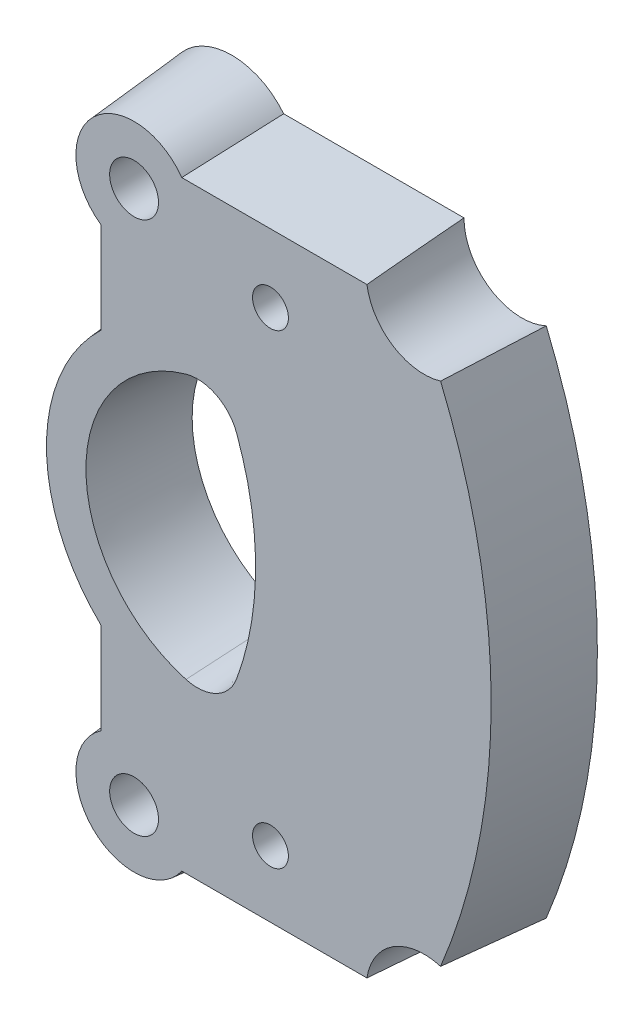
ISO-10303-21;
HEADER;
FILE_DESCRIPTION(('STEP AP214'),'2;1');
FILE_NAME('part.step','',(''),(''),'','','');
FILE_SCHEMA(('AUTOMOTIVE_DESIGN { 1 0 10303 214 1 1 1 1 }'));
ENDSEC;
DATA;
#1=APPLICATION_CONTEXT('core data for automotive mechanical design processes');
#2=APPLICATION_PROTOCOL_DEFINITION('international standard','automotive_design',2000,#1);
#3=PRODUCT_CONTEXT('',#1,'mechanical');
#4=PRODUCT('Part','Part','',(#3));
#5=PRODUCT_RELATED_PRODUCT_CATEGORY('part','',(#4));
#6=PRODUCT_DEFINITION_FORMATION('','',#4);
#7=PRODUCT_DEFINITION_CONTEXT('part definition',#1,'design');
#8=PRODUCT_DEFINITION('design','',#6,#7);
#9=PRODUCT_DEFINITION_SHAPE('','',#8);
#10=(LENGTH_UNIT() NAMED_UNIT(*) SI_UNIT(.MILLI.,.METRE.));
#11=(NAMED_UNIT(*) PLANE_ANGLE_UNIT() SI_UNIT($,.RADIAN.));
#12=(NAMED_UNIT(*) SI_UNIT($,.STERADIAN.) SOLID_ANGLE_UNIT());
#13=UNCERTAINTY_MEASURE_WITH_UNIT(LENGTH_MEASURE(1.E-05),#10,'distance_accuracy_value','');
#14=(GEOMETRIC_REPRESENTATION_CONTEXT(3) GLOBAL_UNCERTAINTY_ASSIGNED_CONTEXT((#13)) GLOBAL_UNIT_ASSIGNED_CONTEXT((#10,
#11,#12)) REPRESENTATION_CONTEXT('',''));
#15=CARTESIAN_POINT('',(0.,0.,0.));
#16=DIRECTION('',(0.,0.,1.));
#17=DIRECTION('',(1.,0.,0.));
#18=AXIS2_PLACEMENT_3D('',#15,#16,#17);
#19=CARTESIAN_POINT('',(-242.568806554444,2.20217828658414,0.));
#20=DIRECTION('',(0.,0.,-1.));
#21=DIRECTION('',(1.,0.,0.));
#22=AXIS2_PLACEMENT_3D('',#19,#20,#21);
#23=CONICAL_SURFACE('',#22,121.736376832172,0.0872664625997167);
#24=CARTESIAN_POINT('',(-242.568806554444,2.20217828658414,17.78));
#25=DIRECTION('',(0.,0.,1.));
#26=DIRECTION('',(1.,0.,0.));
#27=AXIS2_PLACEMENT_3D('',#24,#25,#26);
#28=CIRCLE('',#27,120.180828394681);
#29=CARTESIAN_POINT('',(-131.595061589543,-43.9308840667537,17.78));
#30=VERTEX_POINT('',#29);
#31=CARTESIAN_POINT('',(-131.595061589543,48.335240639922,17.78));
#32=VERTEX_POINT('',#31);
#33=EDGE_CURVE('E141',#30,#32,#28,.T.);
#34=ORIENTED_EDGE('',*,*,#33,.F.);
#35=CARTESIAN_POINT('',(-131.595078456003,-43.9308790560775,17.7802));
#36=CARTESIAN_POINT('',(-131.470129675424,-43.9680056302352,16.2985387701415));
#37=CARTESIAN_POINT('',(-131.346110667115,-44.0073703583966,14.8168558223103));
#38=CARTESIAN_POINT('',(-131.09992474476,-44.0905561661647,11.8534767240976));
#39=CARTESIAN_POINT('',(-130.977757811404,-44.134377199271,10.3717805740151));
#40=CARTESIAN_POINT('',(-130.614019120888,-44.2724964134353,5.92665973146267));
#41=CARTESIAN_POINT('',(-130.375210447984,-44.3734504193753,2.96321420670453));
#42=CARTESIAN_POINT('',(-130.140050940156,-44.4832007465658,-0.00019999999999912));
#43=B_SPLINE_CURVE_WITH_KNOTS('',3,(#35,#36,#37,#38,#39,#40,#41,#42),.UNSPECIFIED.,.F.,.F.,(4,2,
2,4),(0.,4.46214826748927,8.92424997847575,17.8484882137234),.UNSPECIFIED.);
#44=CARTESIAN_POINT('',(-130.14006680977,-44.4831933371806,0.));
#45=VERTEX_POINT('',#44);
#46=EDGE_CURVE('E132',#30,#45,#43,.T.);
#47=ORIENTED_EDGE('',*,*,#46,.T.);
#48=CARTESIAN_POINT('',(-242.568806554444,2.20217828658414,0.));
#49=DIRECTION('',(0.,0.,1.));
#50=DIRECTION('',(1.,0.,0.));
#51=AXIS2_PLACEMENT_3D('',#48,#49,#50);
#52=CIRCLE('',#51,121.736376832172);
#53=CARTESIAN_POINT('',(-130.14006680977,48.8875499103488,0.));
#54=VERTEX_POINT('',#53);
#55=EDGE_CURVE('E53',#45,#54,#52,.T.);
#56=ORIENTED_EDGE('',*,*,#55,.T.);
#57=CARTESIAN_POINT('',(-130.140050940156,48.8875573197341,-0.000200000000000176));
#58=CARTESIAN_POINT('',(-130.375210447984,48.7778069925436,2.96321420670453));
#59=CARTESIAN_POINT('',(-130.614019120888,48.6768529866035,5.92665973146267));
#60=CARTESIAN_POINT('',(-130.977757811404,48.5387337724393,10.3717805740151));
#61=CARTESIAN_POINT('',(-131.09992474476,48.4949127393329,11.8534767240976));
#62=CARTESIAN_POINT('',(-131.346110667115,48.4117269315648,14.8168558223103));
#63=CARTESIAN_POINT('',(-131.470129675424,48.3723622034034,16.2985387701415));
#64=CARTESIAN_POINT('',(-131.595078456003,48.3352356292458,17.7802));
#65=B_SPLINE_CURVE_WITH_KNOTS('',3,(#57,#58,#59,#60,#61,#62,#63,#64),.UNSPECIFIED.,.F.,.F.,(4,2,
2,4),(0.,8.92423823524763,13.3863399462341,17.8484882137234),.UNSPECIFIED.);
#66=EDGE_CURVE('E198',#54,#32,#65,.T.);
#67=ORIENTED_EDGE('',*,*,#66,.T.);
#68=EDGE_LOOP('',(#34,#47,#56,#67));
#69=FACE_BOUND('',#68,.T.);
#70=ADVANCED_FACE('F29',(#69),#23,.T.);
#71=CARTESIAN_POINT('',(-134.591688960852,58.4221704637822,0.));
#72=DIRECTION('',(0.,0.996194698091746,0.0871557427476584));
#73=DIRECTION('',(0.,-0.0871557427476584,0.996194698091746));
#74=AXIS2_PLACEMENT_3D('',#71,#72,#73);
#75=PLANE('',#74);
#76=DIRECTION('',(1.,0.,0.));
#77=VECTOR('',#76,1.);
#78=CARTESIAN_POINT('',(-134.591688960852,56.8666220262913,17.78));
#79=LINE('',#78,#77);
#80=CARTESIAN_POINT('',(-144.998715334057,56.8666220262913,17.78));
#81=VERTEX_POINT('',#80);
#82=CARTESIAN_POINT('',(-178.712968006962,56.8666220262913,17.78));
#83=VERTEX_POINT('',#82);
#84=EDGE_CURVE('E315',#81,#83,#79,.F.);
#85=ORIENTED_EDGE('',*,*,#84,.F.);
#86=CARTESIAN_POINT('',(-134.591688960852,58.4221704637822,0.));
#87=DIRECTION('',(0.,0.996194698091746,0.0871557427476584));
#88=DIRECTION('',(0.,0.0871557427476584,-0.996194698091746));
#89=AXIS2_PLACEMENT_3D('',#86,#87,#88);
#90=ELLIPSE('',#89,120.733741028745,10.5226388740637);
#91=CARTESIAN_POINT('',(-145.114327834916,58.4221704637822,0.));
#92=VERTEX_POINT('',#91);
#93=EDGE_CURVE('E309',#81,#92,#90,.F.);
#94=ORIENTED_EDGE('',*,*,#93,.T.);
#95=DIRECTION('',(-1.,0.,0.));
#96=VECTOR('',#95,1.);
#97=CARTESIAN_POINT('',(-134.591688960852,58.4221704637822,0.));
#98=LINE('',#97,#96);
#99=CARTESIAN_POINT('',(-177.936925130946,58.4221704637822,0.));
#100=VERTEX_POINT('',#99);
#101=EDGE_CURVE('E146',#92,#100,#98,.T.);
#102=ORIENTED_EDGE('',*,*,#101,.T.);
#103=CARTESIAN_POINT('',(-178.712968006962,56.8666220262913,17.78));
#104=CARTESIAN_POINT('',(-178.645414126394,56.9962400365516,16.2984593633449));
#105=CARTESIAN_POINT('',(-178.578643604253,57.1258611391595,14.8168833809947));
#106=CARTESIAN_POINT('',(-178.446573883495,57.3851089273824,11.8536676022318));
#107=CARTESIAN_POINT('',(-178.38127468361,57.5147356129925,10.3720278058751));
#108=CARTESIAN_POINT('',(-178.25205210728,57.7739941701885,7.40868893718567));
#109=CARTESIAN_POINT('',(-178.188128730634,57.9036260417738,5.92698986486156));
#110=CARTESIAN_POINT('',(-178.061576416323,58.1628946974007,2.96353557057853));
#111=CARTESIAN_POINT('',(-177.998947479774,58.2925314814466,1.48178034857231));
#112=CARTESIAN_POINT('',(-177.936925130946,58.4221704637822,0.));
#113=B_SPLINE_CURVE_WITH_KNOTS('',3,(#103,#104,#105,#106,#107,#108,#109,#110,#111,#112),
.UNSPECIFIED.,.F.,.F.,(4,2,2,2,4),(0.,4.46619972246631,8.93239559400562,13.3985908154821,
17.8647898869773),.UNSPECIFIED.);
#114=EDGE_CURVE('E38',#83,#100,#113,.T.);
#115=ORIENTED_EDGE('',*,*,#114,.F.);
#116=EDGE_LOOP('',(#85,#94,#102,#115));
#117=FACE_BOUND('',#116,.T.);
#118=ADVANCED_FACE('F193',(#117),#75,.T.);
#119=CARTESIAN_POINT('',(-187.392025381174,50.8021704637822,0.));
#120=DIRECTION('',(0.,0.,-1.));
#121=DIRECTION('',(1.,0.,0.));
#122=AXIS2_PLACEMENT_3D('',#119,#120,#121);
#123=CONICAL_SURFACE('',#122,12.1434476464412,0.0872664625997167);
#124=CARTESIAN_POINT('',(-187.392025381174,50.8021704637822,0.));
#125=DIRECTION('',(0.,0.,1.));
#126=DIRECTION('',(1.,0.,0.));
#127=AXIS2_PLACEMENT_3D('',#124,#125,#126);
#128=CIRCLE('',#127,12.1434476464412);
#129=CARTESIAN_POINT('',(-195.012025381174,41.3470702135543,0.));
#130=VERTEX_POINT('',#129);
#131=EDGE_CURVE('E149',#100,#130,#128,.T.);
#132=ORIENTED_EDGE('',*,*,#131,.T.);
#133=CARTESIAN_POINT('',(-193.456476943683,42.1231130895697,17.78));
#134=CARTESIAN_POINT('',(-193.586094953943,42.0555592090025,16.2984593633449));
#135=CARTESIAN_POINT('',(-193.715716056551,41.9887886868607,14.8168833809947));
#136=CARTESIAN_POINT('',(-193.974963844774,41.8567189661028,11.8536676022318));
#137=CARTESIAN_POINT('',(-194.104590530384,41.7914197662181,10.3720278058751));
#138=CARTESIAN_POINT('',(-194.36384908758,41.6621971898876,7.40868893718567));
#139=CARTESIAN_POINT('',(-194.493480959166,41.5982738132416,5.92698986486156));
#140=CARTESIAN_POINT('',(-194.752749614793,41.4717214989308,2.96353557057853));
#141=CARTESIAN_POINT('',(-194.882386398838,41.409092562382,1.48178034857231));
#142=CARTESIAN_POINT('',(-195.012025381174,41.3470702135543,0.));
#143=B_SPLINE_CURVE_WITH_KNOTS('',3,(#133,#134,#135,#136,#137,#138,#139,#140,#141,#142),
.UNSPECIFIED.,.F.,.F.,(4,2,2,2,4),(0.,4.46619972246631,8.93239559400562,13.3985908154821,
17.8647898869773),.UNSPECIFIED.);
#144=CARTESIAN_POINT('',(-193.456476943683,42.1231130895697,17.78));
#145=VERTEX_POINT('',#144);
#146=EDGE_CURVE('E462',#145,#130,#143,.T.);
#147=ORIENTED_EDGE('',*,*,#146,.F.);
#148=CARTESIAN_POINT('',(-187.392025381174,50.8021704637822,17.78));
#149=DIRECTION('',(0.,0.,1.));
#150=DIRECTION('',(1.,0.,0.));
#151=AXIS2_PLACEMENT_3D('',#148,#149,#150);
#152=CIRCLE('',#151,10.5878992089503);
#153=EDGE_CURVE('E319',#83,#145,#152,.T.);
#154=ORIENTED_EDGE('',*,*,#153,.F.);
#155=ORIENTED_EDGE('',*,*,#114,.T.);
#156=EDGE_LOOP('',(#132,#147,#154,#155));
#157=FACE_BOUND('',#156,.T.);
#158=ADVANCED_FACE('F31',(#157),#123,.T.);
#159=CARTESIAN_POINT('',(-195.012025381174,26.0628599441298,0.));
#160=DIRECTION('',(-0.996194698091746,0.,0.0871557427476584));
#161=DIRECTION('',(0.0871557427476584,0.,0.996194698091746));
#162=AXIS2_PLACEMENT_3D('',#159,#160,#161);
#163=PLANE('',#162);
#164=DIRECTION('',(0.,-1.,0.));
#165=VECTOR('',#164,1.);
#166=CARTESIAN_POINT('',(-195.012025381174,26.0628599441298,0.));
#167=LINE('',#166,#165);
#168=CARTESIAN_POINT('',(-195.012025381174,26.0628599441298,0.));
#169=VERTEX_POINT('',#168);
#170=EDGE_CURVE('E157',#130,#169,#167,.T.);
#171=ORIENTED_EDGE('',*,*,#170,.T.);
#172=CARTESIAN_POINT('',(-193.456476943683,25.4095878461253,17.78));
#173=CARTESIAN_POINT('',(-193.715730202941,25.5199755947637,14.8167216870205));
#174=CARTESIAN_POINT('',(-193.974985869224,25.6296088106648,11.8534158616148));
#175=CARTESIAN_POINT('',(-194.493502015055,25.8473661766618,5.92674919494794));
#176=CARTESIAN_POINT('',(-194.752762494602,25.9554903267622,2.96338835368704));
#177=CARTESIAN_POINT('',(-195.012025381174,26.0628599441298,0.));
#178=B_SPLINE_CURVE_WITH_KNOTS('',3,(#172,#173,#174,#175,#176,#177),.UNSPECIFIED.,.F.,.F.,(4,2,
4),(0.,8.92993444638388,17.8598688656546),.UNSPECIFIED.);
#179=CARTESIAN_POINT('',(-193.456476943683,25.4095878461253,17.78));
#180=VERTEX_POINT('',#179);
#181=EDGE_CURVE('E467',#180,#169,#178,.T.);
#182=ORIENTED_EDGE('',*,*,#181,.F.);
#183=DIRECTION('',(0.,1.,0.));
#184=VECTOR('',#183,1.);
#185=CARTESIAN_POINT('',(-193.456476943683,26.0628599441298,17.78));
#186=LINE('',#185,#184);
#187=EDGE_CURVE('E321',#145,#180,#186,.F.);
#188=ORIENTED_EDGE('',*,*,#187,.F.);
#189=ORIENTED_EDGE('',*,*,#146,.T.);
#190=EDGE_LOOP('',(#171,#182,#188,#189));
#191=FACE_BOUND('',#190,.T.);
#192=ADVANCED_FACE('F436',(#191),#163,.T.);
#193=CARTESIAN_POINT('',(-171.151343723628,2.20217828658414,0.));
#194=DIRECTION('',(0.,0.,-1.));
#195=DIRECTION('',(1.,0.,0.));
#196=AXIS2_PLACEMENT_3D('',#193,#194,#195);
#197=CONICAL_SURFACE('',#196,33.7440996075683,0.0872664625997167);
#198=CARTESIAN_POINT('',(-171.151343723628,2.20217828658414,0.));
#199=DIRECTION('',(0.,0.,1.));
#200=DIRECTION('',(1.,0.,0.));
#201=AXIS2_PLACEMENT_3D('',#198,#199,#200);
#202=CIRCLE('',#201,33.7440996075683);
#203=CARTESIAN_POINT('',(-195.012025381174,-21.6585033709615,0.));
#204=VERTEX_POINT('',#203);
#205=EDGE_CURVE('E159',#169,#204,#202,.T.);
#206=ORIENTED_EDGE('',*,*,#205,.T.);
#207=CARTESIAN_POINT('',(-193.456476943683,-21.005231272957,17.78));
#208=CARTESIAN_POINT('',(-193.715730202941,-21.1156190215955,14.8167216870205));
#209=CARTESIAN_POINT('',(-193.974985869224,-21.2252522374966,11.8534158616148));
#210=CARTESIAN_POINT('',(-194.493502015055,-21.4430096034935,5.92674919494794));
#211=CARTESIAN_POINT('',(-194.752762494602,-21.5511337535939,2.96338835368704));
#212=CARTESIAN_POINT('',(-195.012025381174,-21.6585033709615,0.));
#213=B_SPLINE_CURVE_WITH_KNOTS('',3,(#207,#208,#209,#210,#211,#212),.UNSPECIFIED.,.F.,.F.,(4,2,
4),(0.,8.92993444638388,17.8598688656546),.UNSPECIFIED.);
#214=CARTESIAN_POINT('',(-193.456476943683,-21.005231272957,17.78));
#215=VERTEX_POINT('',#214);
#216=EDGE_CURVE('E475',#215,#204,#213,.T.);
#217=ORIENTED_EDGE('',*,*,#216,.F.);
#218=CARTESIAN_POINT('',(-171.151343723628,2.20217828658414,17.78));
#219=DIRECTION('',(0.,0.,1.));
#220=DIRECTION('',(1.,0.,0.));
#221=AXIS2_PLACEMENT_3D('',#218,#219,#220);
#222=CIRCLE('',#221,32.1885511700774);
#223=EDGE_CURVE('E327',#180,#215,#222,.T.);
#224=ORIENTED_EDGE('',*,*,#223,.F.);
#225=ORIENTED_EDGE('',*,*,#181,.T.);
#226=EDGE_LOOP('',(#206,#217,#224,#225));
#227=FACE_BOUND('',#226,.T.);
#228=ADVANCED_FACE('F429',(#227),#197,.T.);
#229=CARTESIAN_POINT('',(-195.012025381174,-36.9427136403861,0.));
#230=DIRECTION('',(-0.996194698091746,0.,0.0871557427476584));
#231=DIRECTION('',(0.0871557427476584,0.,0.996194698091746));
#232=AXIS2_PLACEMENT_3D('',#229,#230,#231);
#233=PLANE('',#232);
#234=DIRECTION('',(0.,-1.,0.));
#235=VECTOR('',#234,1.);
#236=CARTESIAN_POINT('',(-195.012025381174,-36.9427136403861,0.));
#237=LINE('',#236,#235);
#238=CARTESIAN_POINT('',(-195.012025381174,-36.9427136403861,0.));
#239=VERTEX_POINT('',#238);
#240=EDGE_CURVE('E161',#204,#239,#237,.T.);
#241=ORIENTED_EDGE('',*,*,#240,.T.);
#242=CARTESIAN_POINT('',(-193.456476943683,-37.7187565164014,17.78));
#243=CARTESIAN_POINT('',(-193.586094953943,-37.6512026358342,16.2984593633449));
#244=CARTESIAN_POINT('',(-193.715716056551,-37.5844321136924,14.8168833809947));
#245=CARTESIAN_POINT('',(-193.974963844774,-37.4523623929345,11.8536676022318));
#246=CARTESIAN_POINT('',(-194.104590530384,-37.3870631930498,10.3720278058751));
#247=CARTESIAN_POINT('',(-194.36384908758,-37.2578406167194,7.40868893718567));
#248=CARTESIAN_POINT('',(-194.493480959166,-37.1939172400733,5.92698986486156));
#249=CARTESIAN_POINT('',(-194.752749614793,-37.0673649257626,2.96353557057853));
#250=CARTESIAN_POINT('',(-194.882386398838,-37.0047359892137,1.48178034857231));
#251=CARTESIAN_POINT('',(-195.012025381174,-36.9427136403861,0.));
#252=B_SPLINE_CURVE_WITH_KNOTS('',3,(#242,#243,#244,#245,#246,#247,#248,#249,#250,#251),
.UNSPECIFIED.,.F.,.F.,(4,2,2,2,4),(0.,4.46619972246631,8.93239559400562,13.3985908154821,
17.8647898869773),.UNSPECIFIED.);
#253=CARTESIAN_POINT('',(-193.456476943683,-37.7187565164014,17.78));
#254=VERTEX_POINT('',#253);
#255=EDGE_CURVE('E175',#254,#239,#252,.T.);
#256=ORIENTED_EDGE('',*,*,#255,.F.);
#257=DIRECTION('',(0.,1.,0.));
#258=VECTOR('',#257,1.);
#259=CARTESIAN_POINT('',(-193.456476943683,-36.9427136403861,17.78));
#260=LINE('',#259,#258);
#261=EDGE_CURVE('E329',#215,#254,#260,.F.);
#262=ORIENTED_EDGE('',*,*,#261,.F.);
#263=ORIENTED_EDGE('',*,*,#216,.T.);
#264=EDGE_LOOP('',(#241,#256,#262,#263));
#265=FACE_BOUND('',#264,.T.);
#266=ADVANCED_FACE('F422',(#265),#233,.T.);
#267=CARTESIAN_POINT('',(-187.392025381174,-46.3978138906139,0.));
#268=DIRECTION('',(0.,0.,-1.));
#269=DIRECTION('',(1.,0.,0.));
#270=AXIS2_PLACEMENT_3D('',#267,#268,#269);
#271=CONICAL_SURFACE('',#270,12.1434476464412,0.0872664625997167);
#272=CARTESIAN_POINT('',(-187.392025381174,-46.3978138906139,0.));
#273=DIRECTION('',(0.,0.,1.));
#274=DIRECTION('',(1.,0.,0.));
#275=AXIS2_PLACEMENT_3D('',#272,#273,#274);
#276=CIRCLE('',#275,12.1434476464412);
#277=CARTESIAN_POINT('',(-177.936925130946,-54.0178138906139,0.));
#278=VERTEX_POINT('',#277);
#279=EDGE_CURVE('E163',#239,#278,#276,.T.);
#280=ORIENTED_EDGE('',*,*,#279,.T.);
#281=CARTESIAN_POINT('',(-178.712968006962,-52.462265453123,17.78));
#282=CARTESIAN_POINT('',(-178.645414126394,-52.5918834633833,16.2984593633449));
#283=CARTESIAN_POINT('',(-178.578643604253,-52.7215045659912,14.8168833809947));
#284=CARTESIAN_POINT('',(-178.446573883495,-52.9807523542141,11.8536676022318));
#285=CARTESIAN_POINT('',(-178.38127468361,-53.1103790398242,10.3720278058751));
#286=CARTESIAN_POINT('',(-178.25205210728,-53.3696375970203,7.40868893718567));
#287=CARTESIAN_POINT('',(-178.188128730634,-53.4992694686055,5.92698986486156));
#288=CARTESIAN_POINT('',(-178.061576416323,-53.7585381242325,2.96353557057853));
#289=CARTESIAN_POINT('',(-177.998947479774,-53.8881749082784,1.48178034857231));
#290=CARTESIAN_POINT('',(-177.936925130946,-54.0178138906139,0.));
#291=B_SPLINE_CURVE_WITH_KNOTS('',3,(#281,#282,#283,#284,#285,#286,#287,#288,#289,#290),
.UNSPECIFIED.,.F.,.F.,(4,2,2,2,4),(0.,4.46619972246631,8.93239559400562,13.3985908154821,
17.8647898869772),.UNSPECIFIED.);
#292=CARTESIAN_POINT('',(-178.712968006962,-52.462265453123,17.78));
#293=VERTEX_POINT('',#292);
#294=EDGE_CURVE('E167',#293,#278,#291,.T.);
#295=ORIENTED_EDGE('',*,*,#294,.F.);
#296=CARTESIAN_POINT('',(-187.392025381174,-46.3978138906139,17.78));
#297=DIRECTION('',(0.,0.,1.));
#298=DIRECTION('',(1.,0.,0.));
#299=AXIS2_PLACEMENT_3D('',#296,#297,#298);
#300=CIRCLE('',#299,10.5878992089503);
#301=EDGE_CURVE('E331',#254,#293,#300,.T.);
#302=ORIENTED_EDGE('',*,*,#301,.F.);
#303=ORIENTED_EDGE('',*,*,#255,.T.);
#304=EDGE_LOOP('',(#280,#295,#302,#303));
#305=FACE_BOUND('',#304,.T.);
#306=ADVANCED_FACE('F182',(#305),#271,.T.);
#307=CARTESIAN_POINT('',(-134.591688960852,-54.0178138906139,0.));
#308=DIRECTION('',(0.,-0.996194698091746,0.0871557427476584));
#309=DIRECTION('',(0.,-0.0871557427476584,-0.996194698091746));
#310=AXIS2_PLACEMENT_3D('',#307,#308,#309);
#311=PLANE('',#310);
#312=DIRECTION('',(1.,0.,0.));
#313=VECTOR('',#312,1.);
#314=CARTESIAN_POINT('',(-134.591688960852,-54.0178138906139,0.));
#315=LINE('',#314,#313);
#316=CARTESIAN_POINT('',(-145.114327834916,-54.0178138906139,0.));
#317=VERTEX_POINT('',#316);
#318=EDGE_CURVE('E165',#278,#317,#315,.T.);
#319=ORIENTED_EDGE('',*,*,#318,.T.);
#320=CARTESIAN_POINT('',(-134.591688960852,-54.0178138906139,0.));
#321=DIRECTION('',(0.,-0.996194698091746,0.0871557427476584));
#322=DIRECTION('',(0.,-0.0871557427476584,-0.996194698091746));
#323=AXIS2_PLACEMENT_3D('',#320,#321,#322);
#324=ELLIPSE('',#323,120.733741028745,10.5226388740637);
#325=CARTESIAN_POINT('',(-144.998715334057,-52.462265453123,17.78));
#326=VERTEX_POINT('',#325);
#327=EDGE_CURVE('E45',#317,#326,#324,.F.);
#328=ORIENTED_EDGE('',*,*,#327,.T.);
#329=DIRECTION('',(-1.,0.,0.));
#330=VECTOR('',#329,1.);
#331=CARTESIAN_POINT('',(-134.591688960852,-52.462265453123,17.78));
#332=LINE('',#331,#330);
#333=EDGE_CURVE('E176',#293,#326,#332,.F.);
#334=ORIENTED_EDGE('',*,*,#333,.F.);
#335=ORIENTED_EDGE('',*,*,#294,.T.);
#336=EDGE_LOOP('',(#319,#328,#334,#335));
#337=FACE_BOUND('',#336,.T.);
#338=ADVANCED_FACE('F184',(#337),#311,.T.);
#339=CARTESIAN_POINT('',(-242.568806554444,2.20217828658414,17.78));
#340=DIRECTION('',(0.,0.,1.));
#341=DIRECTION('',(1.,0.,0.));
#342=AXIS2_PLACEMENT_3D('',#339,#340,#341);
#343=PLANE('',#342);
#344=CARTESIAN_POINT('',(-162.563054604076,-40.3948827833183,17.78));
#345=DIRECTION('',(0.,0.,1.));
#346=DIRECTION('',(1.,0.,0.));
#347=AXIS2_PLACEMENT_3D('',#344,#345,#346);
#348=CIRCLE('',#347,3.26389999999998);
#349=CARTESIAN_POINT('',(-159.299154604076,-40.3948827833183,17.78));
#350=VERTEX_POINT('',#349);
#351=EDGE_CURVE('E256',#350,#350,#348,.T.);
#352=ORIENTED_EDGE('',*,*,#351,.F.);
#353=EDGE_LOOP('',(#352));
#354=FACE_BOUND('',#353,.T.);
#355=CARTESIAN_POINT('',(-162.563054604076,44.4304336329383,17.78));
#356=DIRECTION('',(0.,0.,1.));
#357=DIRECTION('',(1.,0.,0.));
#358=AXIS2_PLACEMENT_3D('',#355,#356,#357);
#359=CIRCLE('',#358,3.26389999999998);
#360=CARTESIAN_POINT('',(-159.299154604076,44.4304336329383,17.78));
#361=VERTEX_POINT('',#360);
#362=EDGE_CURVE('E260',#361,#361,#359,.T.);
#363=ORIENTED_EDGE('',*,*,#362,.F.);
#364=EDGE_LOOP('',(#363));
#365=FACE_BOUND('',#364,.T.);
#366=CARTESIAN_POINT('',(-134.591688960852,-54.0178138906139,17.78));
#367=DIRECTION('',(0.,0.,1.));
#368=DIRECTION('',(1.,0.,0.));
#369=AXIS2_PLACEMENT_3D('',#366,#367,#368);
#370=CIRCLE('',#369,10.5226388740637);
#371=EDGE_CURVE('E137',#30,#326,#370,.T.);
#372=ORIENTED_EDGE('',*,*,#371,.F.);
#373=ORIENTED_EDGE('',*,*,#33,.T.);
#374=CARTESIAN_POINT('',(-134.591688960852,58.4221704637822,17.78));
#375=DIRECTION('',(0.,0.,1.));
#376=DIRECTION('',(1.,0.,0.));
#377=AXIS2_PLACEMENT_3D('',#374,#375,#376);
#378=CIRCLE('',#377,10.5226388740637);
#379=EDGE_CURVE('E142',#81,#32,#378,.T.);
#380=ORIENTED_EDGE('',*,*,#379,.F.);
#381=ORIENTED_EDGE('',*,*,#84,.T.);
#382=ORIENTED_EDGE('',*,*,#153,.T.);
#383=ORIENTED_EDGE('',*,*,#187,.T.);
#384=ORIENTED_EDGE('',*,*,#223,.T.);
#385=ORIENTED_EDGE('',*,*,#261,.T.);
#386=ORIENTED_EDGE('',*,*,#301,.T.);
#387=ORIENTED_EDGE('',*,*,#333,.T.);
#388=EDGE_LOOP('',(#372,#373,#380,#381,#382,#383,#384,#385,#386,#387));
#389=FACE_BOUND('',#388,.T.);
#390=CARTESIAN_POINT('',(-175.868653855233,18.9332147605841,17.78));
#391=DIRECTION('',(0.,0.,1.));
#392=DIRECTION('',(1.,0.,0.));
#393=AXIS2_PLACEMENT_3D('',#390,#391,#392);
#394=CIRCLE('',#393,7.62);
#395=CARTESIAN_POINT('',(-168.717269730354,21.5642041369273,17.78));
#396=VERTEX_POINT('',#395);
#397=CARTESIAN_POINT('',(-177.93648995803,26.2672759719435,17.78));
#398=VERTEX_POINT('',#397);
#399=EDGE_CURVE('E267',#396,#398,#394,.T.);
#400=ORIENTED_EDGE('',*,*,#399,.F.);
#401=CARTESIAN_POINT('',(-221.345868514014,2.20217828658414,17.78));
#402=DIRECTION('',(0.,0.,1.));
#403=DIRECTION('',(-1.,0.,0.));
#404=AXIS2_PLACEMENT_3D('',#401,#402,#403);
#405=CIRCLE('',#404,56.0772454295035);
#406=CARTESIAN_POINT('',(-168.717269730354,-17.159847563759,17.78));
#407=VERTEX_POINT('',#406);
#408=EDGE_CURVE('E294',#407,#396,#405,.T.);
#409=ORIENTED_EDGE('',*,*,#408,.F.);
#410=CARTESIAN_POINT('',(-175.868653855233,-14.5288581874158,17.78));
#411=DIRECTION('',(0.,0.,1.));
#412=DIRECTION('',(-1.,0.,0.));
#413=AXIS2_PLACEMENT_3D('',#410,#411,#412);
#414=CIRCLE('',#413,7.62);
#415=CARTESIAN_POINT('',(-177.93648995803,-21.8629193987753,17.78));
#416=VERTEX_POINT('',#415);
#417=EDGE_CURVE('E304',#416,#407,#414,.T.);
#418=ORIENTED_EDGE('',*,*,#417,.F.);
#419=CARTESIAN_POINT('',(-171.151343723628,2.20217828658414,17.78));
#420=DIRECTION('',(0.,0.,1.));
#421=DIRECTION('',(1.,0.,0.));
#422=AXIS2_PLACEMENT_3D('',#419,#420,#421);
#423=CIRCLE('',#422,25.0033424971166);
#424=EDGE_CURVE('E307',#398,#416,#423,.T.);
#425=ORIENTED_EDGE('',*,*,#424,.F.);
#426=EDGE_LOOP('',(#400,#409,#418,#425));
#427=FACE_BOUND('',#426,.T.);
#428=CARTESIAN_POINT('',(-187.392025381174,-46.3978138906139,17.7800000000161));
#429=DIRECTION('',(0.,0.,1.));
#430=DIRECTION('',(1.,0.,0.));
#431=AXIS2_PLACEMENT_3D('',#428,#429,#430);
#432=CIRCLE('',#431,4.445);
#433=CARTESIAN_POINT('',(-182.947025381174,-46.3978138906139,17.7800000000161));
#434=VERTEX_POINT('',#433);
#435=EDGE_CURVE('E271',#434,#434,#432,.T.);
#436=ORIENTED_EDGE('',*,*,#435,.F.);
#437=EDGE_LOOP('',(#436));
#438=FACE_BOUND('',#437,.T.);
#439=CARTESIAN_POINT('',(-187.392025381174,50.8021704637822,17.7800000000161));
#440=DIRECTION('',(0.,0.,1.));
#441=DIRECTION('',(1.,0.,0.));
#442=AXIS2_PLACEMENT_3D('',#439,#440,#441);
#443=CIRCLE('',#442,4.445);
#444=CARTESIAN_POINT('',(-182.947025381174,50.8021704637822,17.7800000000161));
#445=VERTEX_POINT('',#444);
#446=EDGE_CURVE('E152',#445,#445,#443,.T.);
#447=ORIENTED_EDGE('',*,*,#446,.F.);
#448=EDGE_LOOP('',(#447));
#449=FACE_BOUND('',#448,.T.);
#450=ADVANCED_FACE('F188',(#354,#365,#389,#427,#438,#449),#343,.T.);
#451=CARTESIAN_POINT('',(-242.568806554444,2.20217828658414,0.));
#452=DIRECTION('',(0.,0.,1.));
#453=DIRECTION('',(1.,0.,0.));
#454=AXIS2_PLACEMENT_3D('',#451,#452,#453);
#455=PLANE('',#454);
#456=CARTESIAN_POINT('',(-221.345868514014,2.20217828658414,0.));
#457=DIRECTION('',(0.,0.,1.));
#458=DIRECTION('',(1.,0.,0.));
#459=AXIS2_PLACEMENT_3D('',#456,#457,#458);
#460=CIRCLE('',#459,54.5216969920125);
#461=CARTESIAN_POINT('',(-170.177154822395,-16.622756827089,0.));
#462=VERTEX_POINT('',#461);
#463=CARTESIAN_POINT('',(-170.177154822395,21.0271134002572,0.));
#464=VERTEX_POINT('',#463);
#465=EDGE_CURVE('E288',#462,#464,#460,.T.);
#466=ORIENTED_EDGE('',*,*,#465,.T.);
#467=CARTESIAN_POINT('',(-175.868653855233,18.9332147605841,0.));
#468=DIRECTION('',(0.,0.,1.));
#469=DIRECTION('',(1.,0.,0.));
#470=AXIS2_PLACEMENT_3D('',#467,#468,#469);
#471=CIRCLE('',#470,6.06445156250906);
#472=CARTESIAN_POINT('',(-177.51436145164,24.7700991402122,0.));
#473=VERTEX_POINT('',#472);
#474=EDGE_CURVE('E285',#464,#473,#471,.T.);
#475=ORIENTED_EDGE('',*,*,#474,.T.);
#476=CARTESIAN_POINT('',(-171.151343723628,2.20217828658414,0.));
#477=DIRECTION('',(0.,0.,1.));
#478=DIRECTION('',(1.,0.,0.));
#479=AXIS2_PLACEMENT_3D('',#476,#477,#478);
#480=CIRCLE('',#479,23.4477940596257);
#481=CARTESIAN_POINT('',(-177.51436145164,-20.3657425670439,0.));
#482=VERTEX_POINT('',#481);
#483=EDGE_CURVE('E281',#473,#482,#480,.T.);
#484=ORIENTED_EDGE('',*,*,#483,.T.);
#485=CARTESIAN_POINT('',(-175.868653855233,-14.5288581874158,0.));
#486=DIRECTION('',(0.,0.,1.));
#487=DIRECTION('',(1.,0.,0.));
#488=AXIS2_PLACEMENT_3D('',#485,#486,#487);
#489=CIRCLE('',#488,6.06445156250906);
#490=EDGE_CURVE('E284',#482,#462,#489,.T.);
#491=ORIENTED_EDGE('',*,*,#490,.T.);
#492=EDGE_LOOP('',(#466,#475,#484,#491));
#493=FACE_BOUND('',#492,.T.);
#494=CARTESIAN_POINT('',(-187.392025381174,-46.3978138906139,0.));
#495=DIRECTION('',(0.,0.,1.));
#496=DIRECTION('',(1.,0.,0.));
#497=AXIS2_PLACEMENT_3D('',#494,#495,#496);
#498=CIRCLE('',#497,4.445);
#499=CARTESIAN_POINT('',(-182.947025381174,-46.3978138906139,0.));
#500=VERTEX_POINT('',#499);
#501=EDGE_CURVE('E275',#500,#500,#498,.T.);
#502=ORIENTED_EDGE('',*,*,#501,.T.);
#503=EDGE_LOOP('',(#502));
#504=FACE_BOUND('',#503,.T.);
#505=CARTESIAN_POINT('',(-187.392025381174,50.8021704637822,0.));
#506=DIRECTION('',(0.,0.,1.));
#507=DIRECTION('',(1.,0.,0.));
#508=AXIS2_PLACEMENT_3D('',#505,#506,#507);
#509=CIRCLE('',#508,4.445);
#510=CARTESIAN_POINT('',(-182.947025381174,50.8021704637822,0.));
#511=VERTEX_POINT('',#510);
#512=EDGE_CURVE('E147',#511,#511,#509,.T.);
#513=ORIENTED_EDGE('',*,*,#512,.T.);
#514=EDGE_LOOP('',(#513));
#515=FACE_BOUND('',#514,.T.);
#516=ORIENTED_EDGE('',*,*,#55,.F.);
#517=CARTESIAN_POINT('',(-134.591688960852,-54.0178138906139,0.));
#518=DIRECTION('',(0.,0.,-1.));
#519=DIRECTION('',(-1.,0.,0.));
#520=AXIS2_PLACEMENT_3D('',#517,#518,#519);
#521=CIRCLE('',#520,10.5226388740637);
#522=EDGE_CURVE('E130',#317,#45,#521,.T.);
#523=ORIENTED_EDGE('',*,*,#522,.F.);
#524=ORIENTED_EDGE('',*,*,#318,.F.);
#525=ORIENTED_EDGE('',*,*,#279,.F.);
#526=ORIENTED_EDGE('',*,*,#240,.F.);
#527=ORIENTED_EDGE('',*,*,#205,.F.);
#528=ORIENTED_EDGE('',*,*,#170,.F.);
#529=ORIENTED_EDGE('',*,*,#131,.F.);
#530=ORIENTED_EDGE('',*,*,#101,.F.);
#531=CARTESIAN_POINT('',(-134.591688960852,58.4221704637822,0.));
#532=DIRECTION('',(0.,0.,1.));
#533=DIRECTION('',(1.,0.,0.));
#534=AXIS2_PLACEMENT_3D('',#531,#532,#533);
#535=CIRCLE('',#534,10.5226388740637);
#536=EDGE_CURVE('E11',#92,#54,#535,.T.);
#537=ORIENTED_EDGE('',*,*,#536,.T.);
#538=EDGE_LOOP('',(#516,#523,#524,#525,#526,#527,#528,#529,#530,#537));
#539=FACE_BOUND('',#538,.T.);
#540=ADVANCED_FACE('F144',(#493,#504,#515,#539),#455,.F.);
#541=CARTESIAN_POINT('',(-187.392025381174,50.8021704637822,0.));
#542=DIRECTION('',(0.,0.,1.));
#543=DIRECTION('',(1.,0.,0.));
#544=AXIS2_PLACEMENT_3D('',#541,#542,#543);
#545=CYLINDRICAL_SURFACE('',#544,4.445);
#546=ORIENTED_EDGE('',*,*,#512,.F.);
#547=EDGE_LOOP('',(#546));
#548=FACE_BOUND('',#547,.T.);
#549=ORIENTED_EDGE('',*,*,#446,.T.);
#550=EDGE_LOOP('',(#549));
#551=FACE_BOUND('',#550,.T.);
#552=ADVANCED_FACE('F241',(#548,#551),#545,.F.);
#553=CARTESIAN_POINT('',(-187.392025381174,-46.3978138906139,0.));
#554=DIRECTION('',(0.,0.,1.));
#555=DIRECTION('',(1.,0.,0.));
#556=AXIS2_PLACEMENT_3D('',#553,#554,#555);
#557=CYLINDRICAL_SURFACE('',#556,4.445);
#558=ORIENTED_EDGE('',*,*,#501,.F.);
#559=EDGE_LOOP('',(#558));
#560=FACE_BOUND('',#559,.T.);
#561=ORIENTED_EDGE('',*,*,#435,.T.);
#562=EDGE_LOOP('',(#561));
#563=FACE_BOUND('',#562,.T.);
#564=ADVANCED_FACE('F227',(#560,#563),#557,.F.);
#565=CARTESIAN_POINT('',(-175.868653855233,18.9332147605841,17.78));
#566=DIRECTION('',(0.,0.,1.));
#567=DIRECTION('',(1.,0.,0.));
#568=AXIS2_PLACEMENT_3D('',#565,#566,#567);
#569=CONICAL_SURFACE('',#568,7.62,0.0872664625997167);
#570=ORIENTED_EDGE('',*,*,#399,.T.);
#571=DIRECTION('',(-0.0236514161968154,0.083885243075174,0.996194698091745));
#572=VECTOR('',#571,1.);
#573=CARTESIAN_POINT('',(-177.93648995803,26.2672759719435,17.78));
#574=LINE('',#573,#572);
#575=EDGE_CURVE('E291',#473,#398,#574,.T.);
#576=ORIENTED_EDGE('',*,*,#575,.F.);
#577=ORIENTED_EDGE('',*,*,#474,.F.);
#578=DIRECTION('',(0.081795826125673,0.0300926290362718,0.996194698091745));
#579=VECTOR('',#578,1.);
#580=CARTESIAN_POINT('',(-168.717269730354,21.5642041369273,17.78));
#581=LINE('',#580,#579);
#582=EDGE_CURVE('E280',#464,#396,#581,.T.);
#583=ORIENTED_EDGE('',*,*,#582,.T.);
#584=EDGE_LOOP('',(#570,#576,#577,#583));
#585=FACE_BOUND('',#584,.T.);
#586=ADVANCED_FACE('F223',(#585),#569,.F.);
#587=CARTESIAN_POINT('',(-221.345868514014,2.20217828658414,17.78));
#588=DIRECTION('',(0.,0.,1.));
#589=DIRECTION('',(-1.,0.,0.));
#590=AXIS2_PLACEMENT_3D('',#587,#588,#589);
#591=CONICAL_SURFACE('',#590,56.0772454295035,0.0872664625997167);
#592=ORIENTED_EDGE('',*,*,#408,.T.);
#593=ORIENTED_EDGE('',*,*,#582,.F.);
#594=ORIENTED_EDGE('',*,*,#465,.F.);
#595=DIRECTION('',(0.081795826125673,-0.0300926290362719,0.996194698091745));
#596=VECTOR('',#595,1.);
#597=CARTESIAN_POINT('',(-168.717269730354,-17.159847563759,17.78));
#598=LINE('',#597,#596);
#599=EDGE_CURVE('E295',#462,#407,#598,.T.);
#600=ORIENTED_EDGE('',*,*,#599,.T.);
#601=EDGE_LOOP('',(#592,#593,#594,#600));
#602=FACE_BOUND('',#601,.T.);
#603=ADVANCED_FACE('F226',(#602),#591,.F.);
#604=CARTESIAN_POINT('',(-175.868653855233,-14.5288581874158,17.78));
#605=DIRECTION('',(0.,0.,1.));
#606=DIRECTION('',(-1.,0.,0.));
#607=AXIS2_PLACEMENT_3D('',#604,#605,#606);
#608=CONICAL_SURFACE('',#607,7.62,0.0872664625997167);
#609=ORIENTED_EDGE('',*,*,#417,.T.);
#610=ORIENTED_EDGE('',*,*,#599,.F.);
#611=ORIENTED_EDGE('',*,*,#490,.F.);
#612=DIRECTION('',(-0.0236514161968154,-0.0838852430751739,0.996194698091745));
#613=VECTOR('',#612,1.);
#614=CARTESIAN_POINT('',(-177.93648995803,-21.8629193987753,17.78));
#615=LINE('',#614,#613);
#616=EDGE_CURVE('E297',#482,#416,#615,.T.);
#617=ORIENTED_EDGE('',*,*,#616,.T.);
#618=EDGE_LOOP('',(#609,#610,#611,#617));
#619=FACE_BOUND('',#618,.T.);
#620=ADVANCED_FACE('F231',(#619),#608,.F.);
#621=CARTESIAN_POINT('',(-171.151343723628,2.20217828658414,17.78));
#622=DIRECTION('',(0.,0.,1.));
#623=DIRECTION('',(1.,0.,0.));
#624=AXIS2_PLACEMENT_3D('',#621,#622,#623);
#625=CONICAL_SURFACE('',#624,25.0033424971166,0.0872664625997167);
#626=ORIENTED_EDGE('',*,*,#424,.T.);
#627=ORIENTED_EDGE('',*,*,#616,.F.);
#628=ORIENTED_EDGE('',*,*,#483,.F.);
#629=ORIENTED_EDGE('',*,*,#575,.T.);
#630=EDGE_LOOP('',(#626,#627,#628,#629));
#631=FACE_BOUND('',#630,.T.);
#632=ADVANCED_FACE('F221',(#631),#625,.F.);
#633=CARTESIAN_POINT('',(-134.591688960852,58.4221704637822,26.162));
#634=DIRECTION('',(0.,0.,-1.));
#635=DIRECTION('',(-1.,0.,0.));
#636=AXIS2_PLACEMENT_3D('',#633,#634,#635);
#637=CYLINDRICAL_SURFACE('',#636,10.5226388740637);
#638=ORIENTED_EDGE('',*,*,#536,.F.);
#639=ORIENTED_EDGE('',*,*,#93,.F.);
#640=ORIENTED_EDGE('',*,*,#379,.T.);
#641=ORIENTED_EDGE('',*,*,#66,.F.);
#642=EDGE_LOOP('',(#638,#639,#640,#641));
#643=FACE_BOUND('',#642,.T.);
#644=ADVANCED_FACE('F216',(#643),#637,.F.);
#645=CARTESIAN_POINT('',(-134.591688960852,-54.0178138906139,26.162));
#646=DIRECTION('',(0.,0.,-1.));
#647=DIRECTION('',(-1.,0.,0.));
#648=AXIS2_PLACEMENT_3D('',#645,#646,#647);
#649=CYLINDRICAL_SURFACE('',#648,10.5226388740637);
#650=ORIENTED_EDGE('',*,*,#371,.T.);
#651=ORIENTED_EDGE('',*,*,#327,.F.);
#652=ORIENTED_EDGE('',*,*,#522,.T.);
#653=ORIENTED_EDGE('',*,*,#46,.F.);
#654=EDGE_LOOP('',(#650,#651,#652,#653));
#655=FACE_BOUND('',#654,.T.);
#656=ADVANCED_FACE('F131',(#655),#649,.F.);
#657=CARTESIAN_POINT('',(-162.563054604076,44.4304336329383,10.16));
#658=DIRECTION('',(0.,0.,1.));
#659=DIRECTION('',(1.,0.,0.));
#660=AXIS2_PLACEMENT_3D('',#657,#658,#659);
#661=CYLINDRICAL_SURFACE('',#660,3.26389999999998);
#662=CARTESIAN_POINT('',(-162.563054604076,44.4304336329383,10.16));
#663=DIRECTION('',(0.,0.,1.));
#664=DIRECTION('',(1.,0.,0.));
#665=AXIS2_PLACEMENT_3D('',#662,#663,#664);
#666=CIRCLE('',#665,3.26389999999998);
#667=CARTESIAN_POINT('',(-159.299154604076,44.4304336329383,10.16));
#668=VERTEX_POINT('',#667);
#669=EDGE_CURVE('E138',#668,#668,#666,.T.);
#670=ORIENTED_EDGE('',*,*,#669,.F.);
#671=EDGE_LOOP('',(#670));
#672=FACE_BOUND('',#671,.T.);
#673=ORIENTED_EDGE('',*,*,#362,.T.);
#674=EDGE_LOOP('',(#673));
#675=FACE_BOUND('',#674,.T.);
#676=ADVANCED_FACE('F215',(#672,#675),#661,.F.);
#677=CARTESIAN_POINT('',(-162.563054604076,44.4304336329383,10.16));
#678=DIRECTION('',(0.,0.,1.));
#679=DIRECTION('',(1.,0.,0.));
#680=AXIS2_PLACEMENT_3D('',#677,#678,#679);
#681=PLANE('',#680);
#682=ORIENTED_EDGE('',*,*,#669,.T.);
#683=EDGE_LOOP('',(#682));
#684=FACE_BOUND('',#683,.T.);
#685=ADVANCED_FACE('F346',(#684),#681,.T.);
#686=CARTESIAN_POINT('',(-162.563054604076,-40.3948827833183,10.16));
#687=DIRECTION('',(0.,0.,1.));
#688=DIRECTION('',(1.,0.,0.));
#689=AXIS2_PLACEMENT_3D('',#686,#687,#688);
#690=CYLINDRICAL_SURFACE('',#689,3.26389999999998);
#691=CARTESIAN_POINT('',(-162.563054604076,-40.3948827833183,10.16));
#692=DIRECTION('',(0.,0.,1.));
#693=DIRECTION('',(1.,0.,0.));
#694=AXIS2_PLACEMENT_3D('',#691,#692,#693);
#695=CIRCLE('',#694,3.26389999999998);
#696=CARTESIAN_POINT('',(-159.299154604076,-40.3948827833183,10.16));
#697=VERTEX_POINT('',#696);
#698=EDGE_CURVE('E339',#697,#697,#695,.T.);
#699=ORIENTED_EDGE('',*,*,#698,.F.);
#700=EDGE_LOOP('',(#699));
#701=FACE_BOUND('',#700,.T.);
#702=ORIENTED_EDGE('',*,*,#351,.T.);
#703=EDGE_LOOP('',(#702));
#704=FACE_BOUND('',#703,.T.);
#705=ADVANCED_FACE('F343',(#701,#704),#690,.F.);
#706=CARTESIAN_POINT('',(-162.563054604076,-40.3948827833183,10.16));
#707=DIRECTION('',(0.,0.,1.));
#708=DIRECTION('',(1.,0.,0.));
#709=AXIS2_PLACEMENT_3D('',#706,#707,#708);
#710=PLANE('',#709);
#711=ORIENTED_EDGE('',*,*,#698,.T.);
#712=EDGE_LOOP('',(#711));
#713=FACE_BOUND('',#712,.T.);
#714=ADVANCED_FACE('F345',(#713),#710,.T.);
#715=CLOSED_SHELL('',(#70,#118,#158,#192,#228,#266,#306,#338,#450,#540,#552,#564,#586,#603,#620,
#632,#644,#656,#676,#685,#705,#714));
#716=MANIFOLD_SOLID_BREP('B2',#715);
#717=ADVANCED_BREP_SHAPE_REPRESENTATION('',(#18,#716),#14);
#718=SHAPE_DEFINITION_REPRESENTATION(#9,#717);
ENDSEC;
END-ISO-10303-21;
